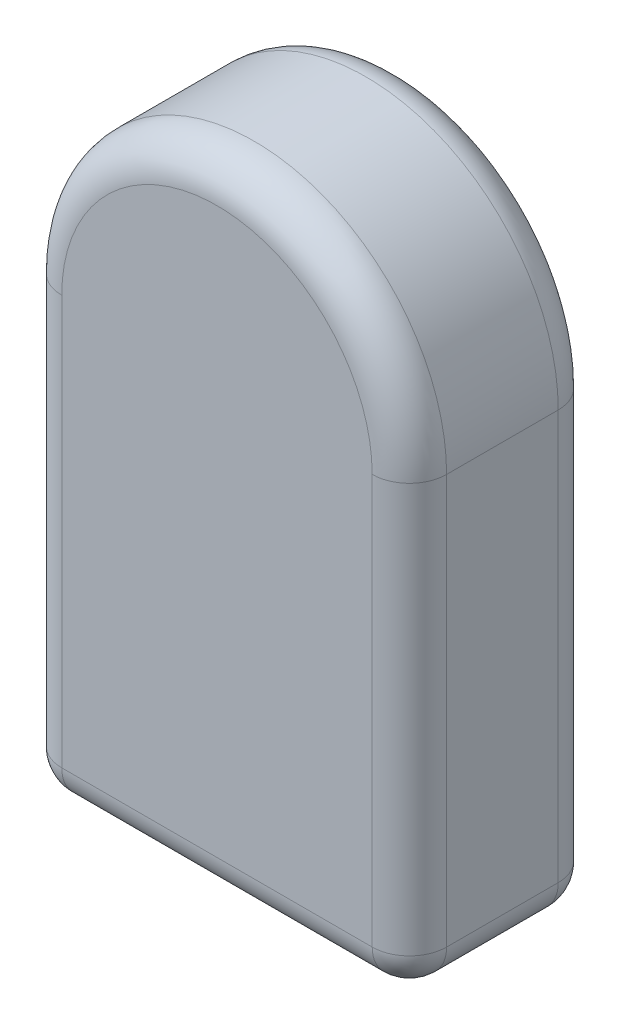
ISO-10303-21;
HEADER;
FILE_DESCRIPTION(('STEP AP214'),'2;1');
FILE_NAME('part.step','',(''),(''),'','','');
FILE_SCHEMA(('AUTOMOTIVE_DESIGN { 1 0 10303 214 1 1 1 1 }'));
ENDSEC;
DATA;
#1=APPLICATION_CONTEXT('core data for automotive mechanical design processes');
#2=APPLICATION_PROTOCOL_DEFINITION('international standard','automotive_design',2000,#1);
#3=PRODUCT_CONTEXT('',#1,'mechanical');
#4=PRODUCT('Part','Part','',(#3));
#5=PRODUCT_RELATED_PRODUCT_CATEGORY('part','',(#4));
#6=PRODUCT_DEFINITION_FORMATION('','',#4);
#7=PRODUCT_DEFINITION_CONTEXT('part definition',#1,'design');
#8=PRODUCT_DEFINITION('design','',#6,#7);
#9=PRODUCT_DEFINITION_SHAPE('','',#8);
#10=(LENGTH_UNIT() NAMED_UNIT(*) SI_UNIT(.MILLI.,.METRE.));
#11=(NAMED_UNIT(*) PLANE_ANGLE_UNIT() SI_UNIT($,.RADIAN.));
#12=(NAMED_UNIT(*) SI_UNIT($,.STERADIAN.) SOLID_ANGLE_UNIT());
#13=UNCERTAINTY_MEASURE_WITH_UNIT(LENGTH_MEASURE(1.E-05),#10,'distance_accuracy_value','');
#14=(GEOMETRIC_REPRESENTATION_CONTEXT(3) GLOBAL_UNCERTAINTY_ASSIGNED_CONTEXT((#13)) GLOBAL_UNIT_ASSIGNED_CONTEXT((#10,
#11,#12)) REPRESENTATION_CONTEXT('',''));
#15=CARTESIAN_POINT('',(0.,0.,0.));
#16=DIRECTION('',(0.,0.,1.));
#17=DIRECTION('',(1.,0.,0.));
#18=AXIS2_PLACEMENT_3D('',#15,#16,#17);
#19=CARTESIAN_POINT('',(1.21063340722227,0.,5.));
#20=DIRECTION('',(0.,1.,0.));
#21=DIRECTION('',(0.,0.,1.));
#22=AXIS2_PLACEMENT_3D('',#19,#20,#21);
#23=PLANE('',#22);
#24=DIRECTION('',(1.,0.,0.));
#25=VECTOR('',#24,1.);
#26=CARTESIAN_POINT('',(1.21063340722227,0.,1.));
#27=LINE('',#26,#25);
#28=CARTESIAN_POINT('',(-8.1320073646024,0.,1.));
#29=VERTEX_POINT('',#28);
#30=CARTESIAN_POINT('',(0.210633407222272,0.,1.));
#31=VERTEX_POINT('',#30);
#32=EDGE_CURVE('E153',#29,#31,#27,.T.);
#33=ORIENTED_EDGE('',*,*,#32,.T.);
#34=DIRECTION('',(0.,0.,-1.));
#35=VECTOR('',#34,1.);
#36=CARTESIAN_POINT('',(0.210633407222272,0.,5.));
#37=LINE('',#36,#35);
#38=CARTESIAN_POINT('',(0.210633407222272,0.,4.));
#39=VERTEX_POINT('',#38);
#40=EDGE_CURVE('E119',#31,#39,#37,.F.);
#41=ORIENTED_EDGE('',*,*,#40,.T.);
#42=DIRECTION('',(1.,0.,0.));
#43=VECTOR('',#42,1.);
#44=CARTESIAN_POINT('',(1.21063340722227,0.,4.));
#45=LINE('',#44,#43);
#46=CARTESIAN_POINT('',(-8.1320073646024,0.,4.));
#47=VERTEX_POINT('',#46);
#48=EDGE_CURVE('E155',#39,#47,#45,.F.);
#49=ORIENTED_EDGE('',*,*,#48,.T.);
#50=DIRECTION('',(0.,0.,-1.));
#51=VECTOR('',#50,1.);
#52=CARTESIAN_POINT('',(-8.1320073646024,0.,5.));
#53=LINE('',#52,#51);
#54=EDGE_CURVE('E151',#47,#29,#53,.T.);
#55=ORIENTED_EDGE('',*,*,#54,.T.);
#56=EDGE_LOOP('',(#33,#41,#49,#55));
#57=FACE_BOUND('',#56,.T.);
#58=ADVANCED_FACE('F32',(#57),#23,.F.);
#59=CARTESIAN_POINT('',(1.21063340722227,12.,5.));
#60=DIRECTION('',(-1.,0.,0.));
#61=DIRECTION('',(0.,0.,1.));
#62=AXIS2_PLACEMENT_3D('',#59,#60,#61);
#63=PLANE('',#62);
#64=DIRECTION('',(0.,0.,-1.));
#65=VECTOR('',#64,1.);
#66=CARTESIAN_POINT('',(1.21063340722227,1.,5.));
#67=LINE('',#66,#65);
#68=CARTESIAN_POINT('',(1.21063340722227,1.,4.));
#69=VERTEX_POINT('',#68);
#70=CARTESIAN_POINT('',(1.21063340722227,1.,1.));
#71=VERTEX_POINT('',#70);
#72=EDGE_CURVE('E145',#69,#71,#67,.T.);
#73=ORIENTED_EDGE('',*,*,#72,.T.);
#74=DIRECTION('',(0.,1.,0.));
#75=VECTOR('',#74,1.);
#76=CARTESIAN_POINT('',(1.21063340722227,12.,1.));
#77=LINE('',#76,#75);
#78=CARTESIAN_POINT('',(1.21063340722227,12.,1.));
#79=VERTEX_POINT('',#78);
#80=EDGE_CURVE('E128',#71,#79,#77,.T.);
#81=ORIENTED_EDGE('',*,*,#80,.T.);
#82=DIRECTION('',(0.,0.,-1.));
#83=VECTOR('',#82,1.);
#84=CARTESIAN_POINT('',(1.21063340722227,12.,5.));
#85=LINE('',#84,#83);
#86=CARTESIAN_POINT('',(1.21063340722227,12.,4.));
#87=VERTEX_POINT('',#86);
#88=EDGE_CURVE('E112',#87,#79,#85,.T.);
#89=ORIENTED_EDGE('',*,*,#88,.F.);
#90=DIRECTION('',(0.,1.,0.));
#91=VECTOR('',#90,1.);
#92=CARTESIAN_POINT('',(1.21063340722227,12.,4.));
#93=LINE('',#92,#91);
#94=EDGE_CURVE('E125',#87,#69,#93,.F.);
#95=ORIENTED_EDGE('',*,*,#94,.T.);
#96=EDGE_LOOP('',(#73,#81,#89,#95));
#97=FACE_BOUND('',#96,.T.);
#98=ADVANCED_FACE('F123',(#97),#63,.F.);
#99=CARTESIAN_POINT('',(-3.96068697869006,12.,5.));
#100=DIRECTION('',(0.,0.,-1.));
#101=DIRECTION('',(-1.,0.,0.));
#102=AXIS2_PLACEMENT_3D('',#99,#100,#101);
#103=CYLINDRICAL_SURFACE('',#102,5.17132038591234);
#104=ORIENTED_EDGE('',*,*,#88,.T.);
#105=CARTESIAN_POINT('',(-3.96068697869006,12.,1.));
#106=DIRECTION('',(0.,0.,-1.));
#107=DIRECTION('',(-1.,0.,0.));
#108=AXIS2_PLACEMENT_3D('',#105,#106,#107);
#109=CIRCLE('',#108,5.17132038591234);
#110=CARTESIAN_POINT('',(-9.1320073646024,12.,1.));
#111=VERTEX_POINT('',#110);
#112=EDGE_CURVE('E118',#79,#111,#109,.F.);
#113=ORIENTED_EDGE('',*,*,#112,.T.);
#114=DIRECTION('',(0.,0.,-1.));
#115=VECTOR('',#114,1.);
#116=CARTESIAN_POINT('',(-9.1320073646024,12.,5.));
#117=LINE('',#116,#115);
#118=CARTESIAN_POINT('',(-9.1320073646024,12.,4.));
#119=VERTEX_POINT('',#118);
#120=EDGE_CURVE('E114',#119,#111,#117,.T.);
#121=ORIENTED_EDGE('',*,*,#120,.F.);
#122=CARTESIAN_POINT('',(-3.96068697869006,12.,4.));
#123=DIRECTION('',(0.,0.,-1.));
#124=DIRECTION('',(-1.,0.,0.));
#125=AXIS2_PLACEMENT_3D('',#122,#123,#124);
#126=CIRCLE('',#125,5.17132038591234);
#127=EDGE_CURVE('E109',#119,#87,#126,.T.);
#128=ORIENTED_EDGE('',*,*,#127,.T.);
#129=EDGE_LOOP('',(#104,#113,#121,#128));
#130=FACE_BOUND('',#129,.T.);
#131=ADVANCED_FACE('F111',(#130),#103,.T.);
#132=CARTESIAN_POINT('',(-9.1320073646024,0.,5.));
#133=DIRECTION('',(1.,0.,0.));
#134=DIRECTION('',(0.,0.,-1.));
#135=AXIS2_PLACEMENT_3D('',#132,#133,#134);
#136=PLANE('',#135);
#137=DIRECTION('',(0.,0.,-1.));
#138=VECTOR('',#137,1.);
#139=CARTESIAN_POINT('',(-9.1320073646024,1.,5.));
#140=LINE('',#139,#138);
#141=CARTESIAN_POINT('',(-9.1320073646024,1.,1.));
#142=VERTEX_POINT('',#141);
#143=CARTESIAN_POINT('',(-9.1320073646024,1.,4.));
#144=VERTEX_POINT('',#143);
#145=EDGE_CURVE('E41',#142,#144,#140,.F.);
#146=ORIENTED_EDGE('',*,*,#145,.T.);
#147=DIRECTION('',(0.,-1.,0.));
#148=VECTOR('',#147,1.);
#149=CARTESIAN_POINT('',(-9.1320073646024,0.,4.));
#150=LINE('',#149,#148);
#151=EDGE_CURVE('E11',#144,#119,#150,.F.);
#152=ORIENTED_EDGE('',*,*,#151,.T.);
#153=ORIENTED_EDGE('',*,*,#120,.T.);
#154=DIRECTION('',(0.,-1.,0.));
#155=VECTOR('',#154,1.);
#156=CARTESIAN_POINT('',(-9.1320073646024,0.,1.));
#157=LINE('',#156,#155);
#158=EDGE_CURVE('E52',#111,#142,#157,.T.);
#159=ORIENTED_EDGE('',*,*,#158,.T.);
#160=EDGE_LOOP('',(#146,#152,#153,#159));
#161=FACE_BOUND('',#160,.T.);
#162=ADVANCED_FACE('F216',(#161),#136,.F.);
#163=CARTESIAN_POINT('',(-3.96068697869006,12.,5.));
#164=DIRECTION('',(0.,0.,-1.));
#165=DIRECTION('',(-1.,0.,0.));
#166=AXIS2_PLACEMENT_3D('',#163,#164,#165);
#167=PLANE('',#166);
#168=DIRECTION('',(0.,1.,0.));
#169=VECTOR('',#168,1.);
#170=CARTESIAN_POINT('',(0.210633407222272,12.,5.));
#171=LINE('',#170,#169);
#172=CARTESIAN_POINT('',(0.210633407222272,1.,5.));
#173=VERTEX_POINT('',#172);
#174=CARTESIAN_POINT('',(0.210633407222272,12.,5.));
#175=VERTEX_POINT('',#174);
#176=EDGE_CURVE('E173',#173,#175,#171,.T.);
#177=ORIENTED_EDGE('',*,*,#176,.T.);
#178=CARTESIAN_POINT('',(-3.96068697869006,12.,5.));
#179=DIRECTION('',(0.,0.,-1.));
#180=DIRECTION('',(-1.,0.,0.));
#181=AXIS2_PLACEMENT_3D('',#178,#179,#180);
#182=CIRCLE('',#181,4.17132038591234);
#183=CARTESIAN_POINT('',(-8.1320073646024,12.,5.));
#184=VERTEX_POINT('',#183);
#185=EDGE_CURVE('E135',#175,#184,#182,.F.);
#186=ORIENTED_EDGE('',*,*,#185,.T.);
#187=DIRECTION('',(0.,-1.,0.));
#188=VECTOR('',#187,1.);
#189=CARTESIAN_POINT('',(-8.1320073646024,12.,5.));
#190=LINE('',#189,#188);
#191=CARTESIAN_POINT('',(-8.1320073646024,1.,5.));
#192=VERTEX_POINT('',#191);
#193=EDGE_CURVE('E169',#184,#192,#190,.T.);
#194=ORIENTED_EDGE('',*,*,#193,.T.);
#195=DIRECTION('',(1.,0.,0.));
#196=VECTOR('',#195,1.);
#197=CARTESIAN_POINT('',(-3.96068697869006,1.,5.));
#198=LINE('',#197,#196);
#199=EDGE_CURVE('E171',#192,#173,#198,.T.);
#200=ORIENTED_EDGE('',*,*,#199,.T.);
#201=EDGE_LOOP('',(#177,#186,#194,#200));
#202=FACE_BOUND('',#201,.T.);
#203=ADVANCED_FACE('F377',(#202),#167,.F.);
#204=CARTESIAN_POINT('',(-3.96068697869006,12.,0.));
#205=DIRECTION('',(0.,0.,-1.));
#206=DIRECTION('',(-1.,0.,0.));
#207=AXIS2_PLACEMENT_3D('',#204,#205,#206);
#208=PLANE('',#207);
#209=DIRECTION('',(0.,-1.,0.));
#210=VECTOR('',#209,1.);
#211=CARTESIAN_POINT('',(-8.1320073646024,12.,0.));
#212=LINE('',#211,#210);
#213=CARTESIAN_POINT('',(-8.1320073646024,1.,0.));
#214=VERTEX_POINT('',#213);
#215=CARTESIAN_POINT('',(-8.1320073646024,12.,0.));
#216=VERTEX_POINT('',#215);
#217=EDGE_CURVE('E160',#214,#216,#212,.F.);
#218=ORIENTED_EDGE('',*,*,#217,.T.);
#219=CARTESIAN_POINT('',(-3.96068697869006,12.,0.));
#220=DIRECTION('',(0.,0.,-1.));
#221=DIRECTION('',(-1.,0.,0.));
#222=AXIS2_PLACEMENT_3D('',#219,#220,#221);
#223=CIRCLE('',#222,4.17132038591234);
#224=CARTESIAN_POINT('',(0.210633407222272,12.,0.));
#225=VERTEX_POINT('',#224);
#226=EDGE_CURVE('E166',#216,#225,#223,.T.);
#227=ORIENTED_EDGE('',*,*,#226,.T.);
#228=DIRECTION('',(0.,1.,0.));
#229=VECTOR('',#228,1.);
#230=CARTESIAN_POINT('',(0.210633407222272,0.,0.));
#231=LINE('',#230,#229);
#232=CARTESIAN_POINT('',(0.210633407222272,1.,0.));
#233=VERTEX_POINT('',#232);
#234=EDGE_CURVE('E164',#225,#233,#231,.F.);
#235=ORIENTED_EDGE('',*,*,#234,.T.);
#236=DIRECTION('',(1.,0.,0.));
#237=VECTOR('',#236,1.);
#238=CARTESIAN_POINT('',(-9.1320073646024,1.,0.));
#239=LINE('',#238,#237);
#240=EDGE_CURVE('E162',#233,#214,#239,.F.);
#241=ORIENTED_EDGE('',*,*,#240,.T.);
#242=EDGE_LOOP('',(#218,#227,#235,#241));
#243=FACE_BOUND('',#242,.T.);
#244=ADVANCED_FACE('F227',(#243),#208,.T.);
#245=CARTESIAN_POINT('',(-8.1320073646024,12.,4.));
#246=DIRECTION('',(0.,-1.,0.));
#247=DIRECTION('',(0.,0.,-1.));
#248=AXIS2_PLACEMENT_3D('',#245,#246,#247);
#249=CYLINDRICAL_SURFACE('',#248,1.);
#250=CARTESIAN_POINT('',(-8.1320073646024,12.,4.));
#251=DIRECTION('',(0.,1.,0.));
#252=DIRECTION('',(0.,0.,1.));
#253=AXIS2_PLACEMENT_3D('',#250,#251,#252);
#254=CIRCLE('',#253,1.);
#255=EDGE_CURVE('E208',#119,#184,#254,.T.);
#256=ORIENTED_EDGE('',*,*,#255,.F.);
#257=ORIENTED_EDGE('',*,*,#151,.F.);
#258=CARTESIAN_POINT('',(-8.1320073646024,1.,4.));
#259=DIRECTION('',(0.,-1.,0.));
#260=DIRECTION('',(1.,0.,0.));
#261=AXIS2_PLACEMENT_3D('',#258,#259,#260);
#262=CIRCLE('',#261,1.);
#263=EDGE_CURVE('E209',#192,#144,#262,.T.);
#264=ORIENTED_EDGE('',*,*,#263,.F.);
#265=ORIENTED_EDGE('',*,*,#193,.F.);
#266=EDGE_LOOP('',(#256,#257,#264,#265));
#267=FACE_BOUND('',#266,.T.);
#268=ADVANCED_FACE('F34',(#267),#249,.T.);
#269=CARTESIAN_POINT('',(-8.1320073646024,0.,1.));
#270=DIRECTION('',(0.,1.,0.));
#271=DIRECTION('',(0.,0.,1.));
#272=AXIS2_PLACEMENT_3D('',#269,#270,#271);
#273=CYLINDRICAL_SURFACE('',#272,1.);
#274=CARTESIAN_POINT('',(-8.1320073646024,1.,1.));
#275=DIRECTION('',(0.,-1.,0.));
#276=DIRECTION('',(0.,0.,-1.));
#277=AXIS2_PLACEMENT_3D('',#274,#275,#276);
#278=CIRCLE('',#277,1.);
#279=EDGE_CURVE('E202',#142,#214,#278,.T.);
#280=ORIENTED_EDGE('',*,*,#279,.F.);
#281=ORIENTED_EDGE('',*,*,#158,.F.);
#282=CARTESIAN_POINT('',(-8.1320073646024,12.,1.));
#283=DIRECTION('',(0.,1.,0.));
#284=DIRECTION('',(0.,0.,1.));
#285=AXIS2_PLACEMENT_3D('',#282,#283,#284);
#286=CIRCLE('',#285,1.);
#287=EDGE_CURVE('E205',#216,#111,#286,.T.);
#288=ORIENTED_EDGE('',*,*,#287,.F.);
#289=ORIENTED_EDGE('',*,*,#217,.F.);
#290=EDGE_LOOP('',(#280,#281,#288,#289));
#291=FACE_BOUND('',#290,.T.);
#292=ADVANCED_FACE('F220',(#291),#273,.T.);
#293=CARTESIAN_POINT('',(-8.1320073646024,1.,5.));
#294=DIRECTION('',(0.,0.,-1.));
#295=DIRECTION('',(-1.,0.,0.));
#296=AXIS2_PLACEMENT_3D('',#293,#294,#295);
#297=CYLINDRICAL_SURFACE('',#296,1.);
#298=CARTESIAN_POINT('',(-8.1320073646024,1.,4.));
#299=DIRECTION('',(0.,0.,1.));
#300=DIRECTION('',(1.,0.,0.));
#301=AXIS2_PLACEMENT_3D('',#298,#299,#300);
#302=CIRCLE('',#301,1.);
#303=EDGE_CURVE('E36',#144,#47,#302,.T.);
#304=ORIENTED_EDGE('',*,*,#303,.F.);
#305=ORIENTED_EDGE('',*,*,#145,.F.);
#306=CARTESIAN_POINT('',(-8.1320073646024,1.,1.));
#307=DIRECTION('',(0.,0.,-1.));
#308=DIRECTION('',(-1.,0.,0.));
#309=AXIS2_PLACEMENT_3D('',#306,#307,#308);
#310=CIRCLE('',#309,1.);
#311=EDGE_CURVE('E199',#29,#142,#310,.T.);
#312=ORIENTED_EDGE('',*,*,#311,.F.);
#313=ORIENTED_EDGE('',*,*,#54,.F.);
#314=EDGE_LOOP('',(#304,#305,#312,#313));
#315=FACE_BOUND('',#314,.T.);
#316=ADVANCED_FACE('F243',(#315),#297,.T.);
#317=CARTESIAN_POINT('',(-8.1320073646024,1.,4.));
#318=DIRECTION('',(0.,0.,1.));
#319=DIRECTION('',(1.,0.,0.));
#320=AXIS2_PLACEMENT_3D('',#317,#318,#319);
#321=SPHERICAL_SURFACE('',#320,1.);
#322=ORIENTED_EDGE('',*,*,#263,.T.);
#323=ORIENTED_EDGE('',*,*,#303,.T.);
#324=CARTESIAN_POINT('',(-8.1320073646024,1.,4.));
#325=DIRECTION('',(-1.,0.,0.));
#326=DIRECTION('',(0.,0.,1.));
#327=AXIS2_PLACEMENT_3D('',#324,#325,#326);
#328=CIRCLE('',#327,1.);
#329=EDGE_CURVE('E138',#192,#47,#328,.F.);
#330=ORIENTED_EDGE('',*,*,#329,.F.);
#331=EDGE_LOOP('',(#322,#323,#330));
#332=FACE_BOUND('',#331,.T.);
#333=ADVANCED_FACE('F245',(#332),#321,.T.);
#334=CARTESIAN_POINT('',(-3.96068697869006,12.,4.));
#335=DIRECTION('',(0.,0.,-1.));
#336=DIRECTION('',(-1.,0.,0.));
#337=AXIS2_PLACEMENT_3D('',#334,#335,#336);
#338=TOROIDAL_SURFACE('',#337,4.17132038591234,1.);
#339=ORIENTED_EDGE('',*,*,#255,.T.);
#340=ORIENTED_EDGE('',*,*,#185,.F.);
#341=CARTESIAN_POINT('',(0.210633407222272,12.,4.));
#342=DIRECTION('',(0.,-1.,0.));
#343=DIRECTION('',(0.,0.,-1.));
#344=AXIS2_PLACEMENT_3D('',#341,#342,#343);
#345=CIRCLE('',#344,1.);
#346=EDGE_CURVE('E132',#87,#175,#345,.T.);
#347=ORIENTED_EDGE('',*,*,#346,.F.);
#348=ORIENTED_EDGE('',*,*,#127,.F.);
#349=EDGE_LOOP('',(#339,#340,#347,#348));
#350=FACE_BOUND('',#349,.T.);
#351=ADVANCED_FACE('F133',(#350),#338,.T.);
#352=CARTESIAN_POINT('',(-3.96068697869006,12.,1.));
#353=DIRECTION('',(0.,0.,-1.));
#354=DIRECTION('',(-1.,0.,0.));
#355=AXIS2_PLACEMENT_3D('',#352,#353,#354);
#356=TOROIDAL_SURFACE('',#355,4.17132038591234,1.);
#357=ORIENTED_EDGE('',*,*,#287,.T.);
#358=ORIENTED_EDGE('',*,*,#112,.F.);
#359=CARTESIAN_POINT('',(0.210633407222272,12.,1.));
#360=DIRECTION('',(0.,-1.,0.));
#361=DIRECTION('',(0.,0.,-1.));
#362=AXIS2_PLACEMENT_3D('',#359,#360,#361);
#363=CIRCLE('',#362,1.);
#364=EDGE_CURVE('E139',#225,#79,#363,.T.);
#365=ORIENTED_EDGE('',*,*,#364,.F.);
#366=ORIENTED_EDGE('',*,*,#226,.F.);
#367=EDGE_LOOP('',(#357,#358,#365,#366));
#368=FACE_BOUND('',#367,.T.);
#369=ADVANCED_FACE('F224',(#368),#356,.T.);
#370=CARTESIAN_POINT('',(-8.1320073646024,1.,1.));
#371=DIRECTION('',(0.,0.,1.));
#372=DIRECTION('',(1.,0.,0.));
#373=AXIS2_PLACEMENT_3D('',#370,#371,#372);
#374=SPHERICAL_SURFACE('',#373,1.);
#375=ORIENTED_EDGE('',*,*,#311,.T.);
#376=ORIENTED_EDGE('',*,*,#279,.T.);
#377=CARTESIAN_POINT('',(-8.1320073646024,1.,1.));
#378=DIRECTION('',(-1.,0.,0.));
#379=DIRECTION('',(0.,0.,1.));
#380=AXIS2_PLACEMENT_3D('',#377,#378,#379);
#381=CIRCLE('',#380,1.);
#382=EDGE_CURVE('E192',#29,#214,#381,.F.);
#383=ORIENTED_EDGE('',*,*,#382,.F.);
#384=EDGE_LOOP('',(#375,#376,#383));
#385=FACE_BOUND('',#384,.T.);
#386=ADVANCED_FACE('F231',(#385),#374,.T.);
#387=CARTESIAN_POINT('',(-3.96068697869006,1.,4.));
#388=DIRECTION('',(1.,0.,0.));
#389=DIRECTION('',(0.,0.,-1.));
#390=AXIS2_PLACEMENT_3D('',#387,#388,#389);
#391=CYLINDRICAL_SURFACE('',#390,1.);
#392=ORIENTED_EDGE('',*,*,#329,.T.);
#393=ORIENTED_EDGE('',*,*,#48,.F.);
#394=CARTESIAN_POINT('',(0.210633407222272,1.,4.));
#395=DIRECTION('',(1.,0.,0.));
#396=DIRECTION('',(0.,0.,-1.));
#397=AXIS2_PLACEMENT_3D('',#394,#395,#396);
#398=CIRCLE('',#397,1.);
#399=EDGE_CURVE('E189',#173,#39,#398,.T.);
#400=ORIENTED_EDGE('',*,*,#399,.F.);
#401=ORIENTED_EDGE('',*,*,#199,.F.);
#402=EDGE_LOOP('',(#392,#393,#400,#401));
#403=FACE_BOUND('',#402,.T.);
#404=ADVANCED_FACE('F280',(#403),#391,.T.);
#405=CARTESIAN_POINT('',(0.210633407222272,12.,4.));
#406=DIRECTION('',(0.,1.,0.));
#407=DIRECTION('',(0.,0.,1.));
#408=AXIS2_PLACEMENT_3D('',#405,#406,#407);
#409=CYLINDRICAL_SURFACE('',#408,1.);
#410=ORIENTED_EDGE('',*,*,#346,.T.);
#411=ORIENTED_EDGE('',*,*,#176,.F.);
#412=CARTESIAN_POINT('',(0.210633407222272,1.,4.));
#413=DIRECTION('',(0.,-1.,0.));
#414=DIRECTION('',(0.,0.,-1.));
#415=AXIS2_PLACEMENT_3D('',#412,#413,#414);
#416=CIRCLE('',#415,1.);
#417=EDGE_CURVE('E143',#69,#173,#416,.T.);
#418=ORIENTED_EDGE('',*,*,#417,.F.);
#419=ORIENTED_EDGE('',*,*,#94,.F.);
#420=EDGE_LOOP('',(#410,#411,#418,#419));
#421=FACE_BOUND('',#420,.T.);
#422=ADVANCED_FACE('F141',(#421),#409,.T.);
#423=CARTESIAN_POINT('',(0.210633407222272,12.,1.));
#424=DIRECTION('',(0.,-1.,0.));
#425=DIRECTION('',(0.,0.,-1.));
#426=AXIS2_PLACEMENT_3D('',#423,#424,#425);
#427=CYLINDRICAL_SURFACE('',#426,1.);
#428=ORIENTED_EDGE('',*,*,#364,.T.);
#429=ORIENTED_EDGE('',*,*,#80,.F.);
#430=CARTESIAN_POINT('',(0.210633407222272,1.,1.));
#431=DIRECTION('',(0.,-1.,0.));
#432=DIRECTION('',(1.,0.,0.));
#433=AXIS2_PLACEMENT_3D('',#430,#431,#432);
#434=CIRCLE('',#433,1.);
#435=EDGE_CURVE('E185',#233,#71,#434,.T.);
#436=ORIENTED_EDGE('',*,*,#435,.F.);
#437=ORIENTED_EDGE('',*,*,#234,.F.);
#438=EDGE_LOOP('',(#428,#429,#436,#437));
#439=FACE_BOUND('',#438,.T.);
#440=ADVANCED_FACE('F274',(#439),#427,.T.);
#441=CARTESIAN_POINT('',(1.21063340722227,1.,1.));
#442=DIRECTION('',(-1.,0.,0.));
#443=DIRECTION('',(0.,0.,1.));
#444=AXIS2_PLACEMENT_3D('',#441,#442,#443);
#445=CYLINDRICAL_SURFACE('',#444,1.);
#446=ORIENTED_EDGE('',*,*,#382,.T.);
#447=ORIENTED_EDGE('',*,*,#240,.F.);
#448=CARTESIAN_POINT('',(0.210633407222272,1.,1.));
#449=DIRECTION('',(1.,0.,0.));
#450=DIRECTION('',(0.,0.,-1.));
#451=AXIS2_PLACEMENT_3D('',#448,#449,#450);
#452=CIRCLE('',#451,1.);
#453=EDGE_CURVE('E182',#31,#233,#452,.T.);
#454=ORIENTED_EDGE('',*,*,#453,.F.);
#455=ORIENTED_EDGE('',*,*,#32,.F.);
#456=EDGE_LOOP('',(#446,#447,#454,#455));
#457=FACE_BOUND('',#456,.T.);
#458=ADVANCED_FACE('F235',(#457),#445,.T.);
#459=CARTESIAN_POINT('',(0.210633407222272,1.,4.));
#460=DIRECTION('',(0.,0.,1.));
#461=DIRECTION('',(1.,0.,0.));
#462=AXIS2_PLACEMENT_3D('',#459,#460,#461);
#463=SPHERICAL_SURFACE('',#462,1.);
#464=ORIENTED_EDGE('',*,*,#417,.T.);
#465=ORIENTED_EDGE('',*,*,#399,.T.);
#466=CARTESIAN_POINT('',(0.210633407222272,1.,4.));
#467=DIRECTION('',(0.,0.,1.));
#468=DIRECTION('',(1.,0.,0.));
#469=AXIS2_PLACEMENT_3D('',#466,#467,#468);
#470=CIRCLE('',#469,1.);
#471=EDGE_CURVE('E180',#69,#39,#470,.F.);
#472=ORIENTED_EDGE('',*,*,#471,.F.);
#473=EDGE_LOOP('',(#464,#465,#472));
#474=FACE_BOUND('',#473,.T.);
#475=ADVANCED_FACE('F267',(#474),#463,.T.);
#476=CARTESIAN_POINT('',(0.210633407222272,1.,1.));
#477=DIRECTION('',(0.,0.,1.));
#478=DIRECTION('',(1.,0.,0.));
#479=AXIS2_PLACEMENT_3D('',#476,#477,#478);
#480=SPHERICAL_SURFACE('',#479,1.);
#481=ORIENTED_EDGE('',*,*,#453,.T.);
#482=ORIENTED_EDGE('',*,*,#435,.T.);
#483=CARTESIAN_POINT('',(0.210633407222272,1.,1.));
#484=DIRECTION('',(0.,0.,-1.));
#485=DIRECTION('',(-1.,0.,0.));
#486=AXIS2_PLACEMENT_3D('',#483,#484,#485);
#487=CIRCLE('',#486,1.);
#488=EDGE_CURVE('E178',#31,#71,#487,.F.);
#489=ORIENTED_EDGE('',*,*,#488,.F.);
#490=EDGE_LOOP('',(#481,#482,#489));
#491=FACE_BOUND('',#490,.T.);
#492=ADVANCED_FACE('F263',(#491),#480,.T.);
#493=CARTESIAN_POINT('',(0.210633407222272,1.,5.));
#494=DIRECTION('',(0.,0.,-1.));
#495=DIRECTION('',(-1.,0.,0.));
#496=AXIS2_PLACEMENT_3D('',#493,#494,#495);
#497=CYLINDRICAL_SURFACE('',#496,1.);
#498=ORIENTED_EDGE('',*,*,#471,.T.);
#499=ORIENTED_EDGE('',*,*,#40,.F.);
#500=ORIENTED_EDGE('',*,*,#488,.T.);
#501=ORIENTED_EDGE('',*,*,#72,.F.);
#502=EDGE_LOOP('',(#498,#499,#500,#501));
#503=FACE_BOUND('',#502,.T.);
#504=ADVANCED_FACE('F260',(#503),#497,.T.);
#505=CLOSED_SHELL('',(#58,#98,#131,#162,#203,#244,#268,#292,#316,#333,#351,#369,#386,#404,#422,
#440,#458,#475,#492,#504));
#506=MANIFOLD_SOLID_BREP('B2',#505);
#507=ADVANCED_BREP_SHAPE_REPRESENTATION('',(#18,#506),#14);
#508=SHAPE_DEFINITION_REPRESENTATION(#9,#507);
ENDSEC;
END-ISO-10303-21;
